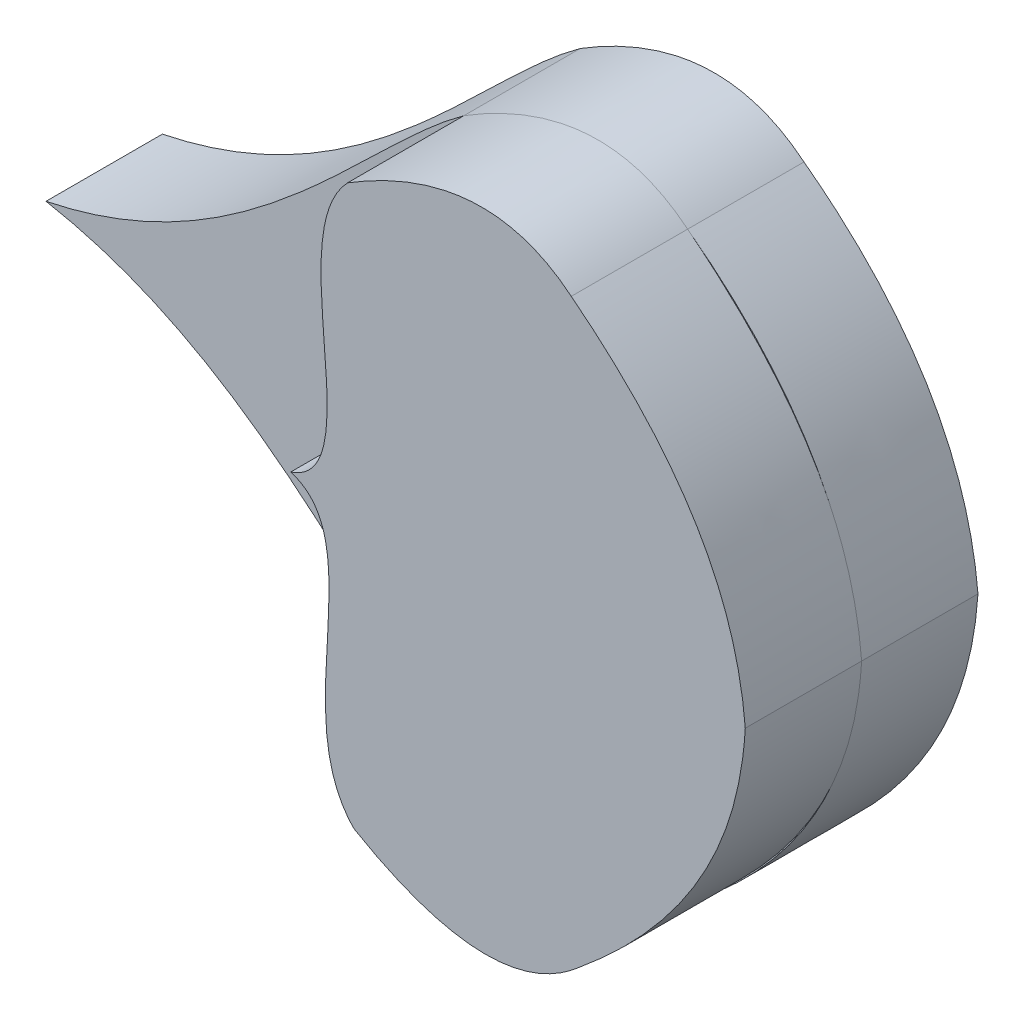
ISO-10303-21;
HEADER;
FILE_DESCRIPTION(('STEP AP214'),'2;1');
FILE_NAME('part.step','',(''),(''),'','','');
FILE_SCHEMA(('AUTOMOTIVE_DESIGN { 1 0 10303 214 1 1 1 1 }'));
ENDSEC;
DATA;
#1=APPLICATION_CONTEXT('core data for automotive mechanical design processes');
#2=APPLICATION_PROTOCOL_DEFINITION('international standard','automotive_design',2000,#1);
#3=PRODUCT_CONTEXT('',#1,'mechanical');
#4=PRODUCT('Part','Part','',(#3));
#5=PRODUCT_RELATED_PRODUCT_CATEGORY('part','',(#4));
#6=PRODUCT_DEFINITION_FORMATION('','',#4);
#7=PRODUCT_DEFINITION_CONTEXT('part definition',#1,'design');
#8=PRODUCT_DEFINITION('design','',#6,#7);
#9=PRODUCT_DEFINITION_SHAPE('','',#8);
#10=(LENGTH_UNIT() NAMED_UNIT(*) SI_UNIT(.MILLI.,.METRE.));
#11=(NAMED_UNIT(*) PLANE_ANGLE_UNIT() SI_UNIT($,.RADIAN.));
#12=(NAMED_UNIT(*) SI_UNIT($,.STERADIAN.) SOLID_ANGLE_UNIT());
#13=UNCERTAINTY_MEASURE_WITH_UNIT(LENGTH_MEASURE(1.E-05),#10,'distance_accuracy_value','');
#14=(GEOMETRIC_REPRESENTATION_CONTEXT(3) GLOBAL_UNCERTAINTY_ASSIGNED_CONTEXT((#13)) GLOBAL_UNIT_ASSIGNED_CONTEXT((#10,
#11,#12)) REPRESENTATION_CONTEXT('',''));
#15=CARTESIAN_POINT('',(0.,0.,0.));
#16=DIRECTION('',(0.,0.,1.));
#17=DIRECTION('',(1.,0.,0.));
#18=AXIS2_PLACEMENT_3D('',#15,#16,#17);
#19=CARTESIAN_POINT('',(968.022053994673,850.236833230224,10.));
#20=DIRECTION('',(0.,0.,1.));
#21=DIRECTION('',(1.,0.,0.));
#22=AXIS2_PLACEMENT_3D('',#19,#20,#21);
#23=PLANE('',#22);
#24=CARTESIAN_POINT('',(957.735487359216,838.736040902496,10.));
#25=CARTESIAN_POINT('',(968.378453265853,847.487101285989,10.));
#26=CARTESIAN_POINT('',(971.635757035158,855.924269837102,10.));
#27=CARTESIAN_POINT('',(972.099331726967,863.749046704113,10.));
#28=B_SPLINE_CURVE_WITH_KNOTS('',3,(#24,#25,#26,#27),.UNSPECIFIED.,.F.,.F.,(4,4),(0.,1.),.UNSPECIFIED.);
#29=CARTESIAN_POINT('',(957.735487359216,838.736040902496,10.));
#30=VERTEX_POINT('',#29);
#31=CARTESIAN_POINT('',(969.549702532147,853.257177179048,10.));
#32=VERTEX_POINT('',#31);
#33=EDGE_CURVE('E246',#30,#32,#28,.T.);
#34=ORIENTED_EDGE('',*,*,#33,.F.);
#35=CARTESIAN_POINT('',(957.735487359216,838.736040902496,10.));
#36=CARTESIAN_POINT('',(971.126698446254,849.231122657143,10.));
#37=CARTESIAN_POINT('',(972.099331726967,863.749046704113,10.));
#38=B_SPLINE_CURVE_WITH_KNOTS('',2,(#35,#36,#37),.UNSPECIFIED.,.F.,.F.,(3,3),(0.,1.),.UNSPECIFIED.);
#39=EDGE_CURVE('E271',#30,#32,#38,.T.);
#40=ORIENTED_EDGE('',*,*,#39,.T.);
#41=EDGE_LOOP('',(#34,#40));
#42=FACE_BOUND('',#41,.T.);
#43=ADVANCED_FACE('F33',(#42),#23,.T.);
#44=CARTESIAN_POINT('',(933.035426869075,863.284850394102,10.));
#45=CARTESIAN_POINT('',(940.179366522484,861.097735963319,10.));
#46=CARTESIAN_POINT('',(932.525850216012,845.382720608083,10.));
#47=CARTESIAN_POINT('',(938.486444548531,839.444092274462,10.));
#48=B_SPLINE_CURVE_WITH_KNOTS('',3,(#44,#45,#46,#47),.UNSPECIFIED.,.F.,.F.,(4,4),(0.,1.),.UNSPECIFIED.);
#49=CARTESIAN_POINT('',(933.035426869075,863.284850394102,10.));
#50=VERTEX_POINT('',#49);
#51=CARTESIAN_POINT('',(938.486444548531,839.444092274462,10.));
#52=VERTEX_POINT('',#51);
#53=EDGE_CURVE('E50',#50,#52,#48,.T.);
#54=ORIENTED_EDGE('',*,*,#53,.F.);
#55=CARTESIAN_POINT('',(937.918385962368,887.24840714084,10.));
#56=CARTESIAN_POINT('',(932.100592224003,881.169816243304,10.));
#57=CARTESIAN_POINT('',(940.12537766323,865.641106119051,10.));
#58=CARTESIAN_POINT('',(933.035426869075,863.284850394102,10.));
#59=B_SPLINE_CURVE_WITH_KNOTS('',3,(#55,#56,#57,#58),.UNSPECIFIED.,.F.,.F.,(4,4),(0.,1.),.UNSPECIFIED.);
#60=CARTESIAN_POINT('',(937.918385962368,887.24840714084,10.));
#61=VERTEX_POINT('',#60);
#62=EDGE_CURVE('E229',#61,#50,#59,.T.);
#63=ORIENTED_EDGE('',*,*,#62,.F.);
#64=CARTESIAN_POINT('',(937.918385962368,887.24840714084,10.));
#65=CARTESIAN_POINT('',(929.194376628945,880.985015824536,10.));
#66=CARTESIAN_POINT('',(919.818300000637,866.577185524126,10.));
#67=CARTESIAN_POINT('',(902.002218730464,862.916082838524,10.));
#68=B_SPLINE_CURVE_WITH_KNOTS('',3,(#64,#65,#66,#67),.UNSPECIFIED.,.F.,.F.,(4,4),(0.,1.),.UNSPECIFIED.);
#69=CARTESIAN_POINT('',(902.002218730464,862.916082838524,10.));
#70=VERTEX_POINT('',#69);
#71=EDGE_CURVE('E284',#61,#70,#68,.T.);
#72=ORIENTED_EDGE('',*,*,#71,.T.);
#73=CARTESIAN_POINT('',(902.002218730464,862.916082838524,10.));
#74=CARTESIAN_POINT('',(919.900266717,859.679371085589,10.));
#75=CARTESIAN_POINT('',(929.61606390718,845.498409486861,10.));
#76=CARTESIAN_POINT('',(938.486444548531,839.444092274462,10.));
#77=B_SPLINE_CURVE_WITH_KNOTS('',3,(#73,#74,#75,#76),.UNSPECIFIED.,.F.,.F.,(4,4),(0.,1.),.UNSPECIFIED.);
#78=EDGE_CURVE('E304',#70,#52,#77,.T.);
#79=ORIENTED_EDGE('',*,*,#78,.T.);
#80=EDGE_LOOP('',(#54,#63,#72,#79));
#81=FACE_BOUND('',#80,.T.);
#82=ADVANCED_FACE('F339',(#81),#23,.T.);
#83=DIRECTION('',(0.,0.,-1.));
#84=VECTOR('',#83,1.);
#85=SURFACE_OF_LINEAR_EXTRUSION('',#38,#84);
#86=CARTESIAN_POINT('',(957.735487359216,838.736040902496,0.));
#87=CARTESIAN_POINT('',(971.126698446254,849.231122657143,0.));
#88=CARTESIAN_POINT('',(972.099331726967,863.749046704113,0.));
#89=B_SPLINE_CURVE_WITH_KNOTS('',2,(#86,#87,#88),.UNSPECIFIED.,.F.,.F.,(3,3),(0.,1.),.UNSPECIFIED.);
#90=CARTESIAN_POINT('',(957.735487359216,838.736040902496,0.));
#91=VERTEX_POINT('',#90);
#92=CARTESIAN_POINT('',(972.099331726967,863.749046704113,0.));
#93=VERTEX_POINT('',#92);
#94=EDGE_CURVE('E141',#91,#93,#89,.T.);
#95=ORIENTED_EDGE('',*,*,#94,.T.);
#96=DIRECTION('',(0.,0.,-1.));
#97=VECTOR('',#96,1.);
#98=CARTESIAN_POINT('',(972.099331726967,863.749046704113,10.));
#99=LINE('',#98,#97);
#100=CARTESIAN_POINT('',(972.099331726967,863.749046704113,10.));
#101=VERTEX_POINT('',#100);
#102=EDGE_CURVE('E43',#101,#93,#99,.T.);
#103=ORIENTED_EDGE('',*,*,#102,.F.);
#104=EDGE_CURVE('E275',#32,#101,#38,.T.);
#105=ORIENTED_EDGE('',*,*,#104,.F.);
#106=ORIENTED_EDGE('',*,*,#39,.F.);
#107=DIRECTION('',(0.,0.,-1.));
#108=VECTOR('',#107,1.);
#109=CARTESIAN_POINT('',(957.735487359216,838.736040902496,10.));
#110=LINE('',#109,#108);
#111=EDGE_CURVE('E454',#30,#91,#110,.T.);
#112=ORIENTED_EDGE('',*,*,#111,.T.);
#113=EDGE_LOOP('',(#95,#103,#105,#106,#112));
#114=FACE_BOUND('',#113,.T.);
#115=ADVANCED_FACE('F35',(#114),#85,.F.);
#116=CARTESIAN_POINT('',(972.099331726967,863.749046704113,10.));
#117=CARTESIAN_POINT('',(970.781988873994,878.239758968873,10.));
#118=CARTESIAN_POINT('',(957.145168223018,888.413666671788,10.));
#119=B_SPLINE_CURVE_WITH_KNOTS('',2,(#116,#117,#118),.UNSPECIFIED.,.F.,.F.,(3,3),(0.,1.),.UNSPECIFIED.);
#120=DIRECTION('',(0.,0.,-1.));
#121=VECTOR('',#120,1.);
#122=SURFACE_OF_LINEAR_EXTRUSION('',#119,#121);
#123=CARTESIAN_POINT('',(972.099331726967,863.749046704113,0.));
#124=CARTESIAN_POINT('',(970.781988873994,878.239758968873,0.));
#125=CARTESIAN_POINT('',(957.145168223018,888.413666671788,0.));
#126=B_SPLINE_CURVE_WITH_KNOTS('',2,(#123,#124,#125),.UNSPECIFIED.,.F.,.F.,(3,3),(0.,1.),.UNSPECIFIED.);
#127=CARTESIAN_POINT('',(957.145168223018,888.413666671788,0.));
#128=VERTEX_POINT('',#127);
#129=EDGE_CURVE('E144',#93,#128,#126,.T.);
#130=ORIENTED_EDGE('',*,*,#129,.T.);
#131=DIRECTION('',(0.,0.,-1.));
#132=VECTOR('',#131,1.);
#133=CARTESIAN_POINT('',(957.145168223018,888.413666671788,10.));
#134=LINE('',#133,#132);
#135=CARTESIAN_POINT('',(957.145168223018,888.413666671788,10.));
#136=VERTEX_POINT('',#135);
#137=EDGE_CURVE('E291',#136,#128,#134,.T.);
#138=ORIENTED_EDGE('',*,*,#137,.F.);
#139=CARTESIAN_POINT('',(969.301107946427,874.177367702007,10.));
#140=VERTEX_POINT('',#139);
#141=EDGE_CURVE('E274',#140,#136,#119,.T.);
#142=ORIENTED_EDGE('',*,*,#141,.F.);
#143=EDGE_CURVE('E280',#101,#140,#119,.T.);
#144=ORIENTED_EDGE('',*,*,#143,.F.);
#145=ORIENTED_EDGE('',*,*,#102,.T.);
#146=EDGE_LOOP('',(#130,#138,#142,#144,#145));
#147=FACE_BOUND('',#146,.T.);
#148=ADVANCED_FACE('F332',(#147),#122,.F.);
#149=CARTESIAN_POINT('',(957.145168223018,888.413666671788,10.));
#150=CARTESIAN_POINT('',(949.699675094382,894.522789238874,10.));
#151=CARTESIAN_POINT('',(937.918385962368,887.24840714084,10.));
#152=B_SPLINE_CURVE_WITH_KNOTS('',2,(#149,#150,#151),.UNSPECIFIED.,.F.,.F.,(3,3),(0.,1.),.UNSPECIFIED.);
#153=DIRECTION('',(0.,0.,-1.));
#154=VECTOR('',#153,1.);
#155=SURFACE_OF_LINEAR_EXTRUSION('',#152,#154);
#156=CARTESIAN_POINT('',(957.145168223018,888.413666671788,0.));
#157=CARTESIAN_POINT('',(949.699675094382,894.522789238874,0.));
#158=CARTESIAN_POINT('',(937.918385962368,887.24840714084,0.));
#159=B_SPLINE_CURVE_WITH_KNOTS('',2,(#156,#157,#158),.UNSPECIFIED.,.F.,.F.,(3,3),(0.,1.),.UNSPECIFIED.);
#160=CARTESIAN_POINT('',(937.918385962368,887.24840714084,0.));
#161=VERTEX_POINT('',#160);
#162=EDGE_CURVE('E379',#128,#161,#159,.T.);
#163=ORIENTED_EDGE('',*,*,#162,.T.);
#164=DIRECTION('',(0.,0.,-1.));
#165=VECTOR('',#164,1.);
#166=CARTESIAN_POINT('',(937.918385962368,887.24840714084,10.));
#167=LINE('',#166,#165);
#168=EDGE_CURVE('E294',#61,#161,#167,.T.);
#169=ORIENTED_EDGE('',*,*,#168,.F.);
#170=CARTESIAN_POINT('',(957.145168223018,888.413666671788,10.));
#171=CARTESIAN_POINT('',(949.711771305971,894.537501805254,10.));
#172=CARTESIAN_POINT('',(937.918385962368,887.24840714084,10.));
#173=B_SPLINE_CURVE_WITH_KNOTS('',2,(#170,#171,#172),.UNSPECIFIED.,.F.,.F.,(3,3),(0.,1.),.UNSPECIFIED.);
#174=EDGE_CURVE('E156',#136,#61,#173,.T.);
#175=ORIENTED_EDGE('',*,*,#174,.F.);
#176=ORIENTED_EDGE('',*,*,#137,.T.);
#177=EDGE_LOOP('',(#163,#169,#175,#176));
#178=FACE_BOUND('',#177,.T.);
#179=ADVANCED_FACE('F327',(#178),#155,.F.);
#180=DIRECTION('',(0.,0.,-1.));
#181=VECTOR('',#180,1.);
#182=SURFACE_OF_LINEAR_EXTRUSION('',#68,#181);
#183=CARTESIAN_POINT('',(937.918385962368,887.24840714084,0.));
#184=CARTESIAN_POINT('',(929.194376628945,880.985015824536,0.));
#185=CARTESIAN_POINT('',(919.818300000637,866.577185524126,0.));
#186=CARTESIAN_POINT('',(902.002218730464,862.916082838524,0.));
#187=B_SPLINE_CURVE_WITH_KNOTS('',3,(#183,#184,#185,#186),.UNSPECIFIED.,.F.,.F.,(4,4),(0.,1.),.UNSPECIFIED.);
#188=CARTESIAN_POINT('',(902.002218730464,862.916082838524,0.));
#189=VERTEX_POINT('',#188);
#190=EDGE_CURVE('E386',#161,#189,#187,.T.);
#191=ORIENTED_EDGE('',*,*,#190,.T.);
#192=DIRECTION('',(0.,0.,-1.));
#193=VECTOR('',#192,1.);
#194=CARTESIAN_POINT('',(902.002218730464,862.916082838524,10.));
#195=LINE('',#194,#193);
#196=EDGE_CURVE('E299',#70,#189,#195,.T.);
#197=ORIENTED_EDGE('',*,*,#196,.F.);
#198=ORIENTED_EDGE('',*,*,#71,.F.);
#199=ORIENTED_EDGE('',*,*,#168,.T.);
#200=EDGE_LOOP('',(#191,#197,#198,#199));
#201=FACE_BOUND('',#200,.T.);
#202=ADVANCED_FACE('F323',(#201),#182,.F.);
#203=DIRECTION('',(0.,0.,-1.));
#204=VECTOR('',#203,1.);
#205=SURFACE_OF_LINEAR_EXTRUSION('',#77,#204);
#206=CARTESIAN_POINT('',(902.002218730464,862.916082838524,0.));
#207=CARTESIAN_POINT('',(919.900266717,859.679371085589,0.));
#208=CARTESIAN_POINT('',(929.61606390718,845.498409486861,0.));
#209=CARTESIAN_POINT('',(938.486444548531,839.444092274462,0.));
#210=B_SPLINE_CURVE_WITH_KNOTS('',3,(#206,#207,#208,#209),.UNSPECIFIED.,.F.,.F.,(4,4),(0.,1.),.UNSPECIFIED.);
#211=CARTESIAN_POINT('',(938.486444548531,839.444092274462,0.));
#212=VERTEX_POINT('',#211);
#213=EDGE_CURVE('E393',#189,#212,#210,.T.);
#214=ORIENTED_EDGE('',*,*,#213,.T.);
#215=DIRECTION('',(0.,0.,-1.));
#216=VECTOR('',#215,1.);
#217=CARTESIAN_POINT('',(938.486444548531,839.444092274462,10.));
#218=LINE('',#217,#216);
#219=EDGE_CURVE('E411',#52,#212,#218,.T.);
#220=ORIENTED_EDGE('',*,*,#219,.F.);
#221=ORIENTED_EDGE('',*,*,#78,.F.);
#222=ORIENTED_EDGE('',*,*,#196,.T.);
#223=EDGE_LOOP('',(#214,#220,#221,#222));
#224=FACE_BOUND('',#223,.T.);
#225=ADVANCED_FACE('F326',(#224),#205,.F.);
#226=CARTESIAN_POINT('',(938.486444548531,839.444092274462,10.));
#227=CARTESIAN_POINT('',(950.437265510964,832.451718797294,10.));
#228=CARTESIAN_POINT('',(957.735487359216,838.736040902496,10.));
#229=B_SPLINE_CURVE_WITH_KNOTS('',2,(#226,#227,#228),.UNSPECIFIED.,.F.,.F.,(3,3),(0.,1.),.UNSPECIFIED.);
#230=DIRECTION('',(0.,0.,-1.));
#231=VECTOR('',#230,1.);
#232=SURFACE_OF_LINEAR_EXTRUSION('',#229,#231);
#233=CARTESIAN_POINT('',(938.486444548531,839.444092274462,0.));
#234=CARTESIAN_POINT('',(950.437265510964,832.451718797294,0.));
#235=CARTESIAN_POINT('',(957.735487359216,838.736040902496,0.));
#236=B_SPLINE_CURVE_WITH_KNOTS('',2,(#233,#234,#235),.UNSPECIFIED.,.F.,.F.,(3,3),(0.,1.),.UNSPECIFIED.);
#237=EDGE_CURVE('E279',#212,#91,#236,.T.);
#238=ORIENTED_EDGE('',*,*,#237,.T.);
#239=ORIENTED_EDGE('',*,*,#111,.F.);
#240=CARTESIAN_POINT('',(938.486444548531,839.444092274462,10.));
#241=CARTESIAN_POINT('',(950.44970791636,832.437297823255,10.));
#242=CARTESIAN_POINT('',(957.735487359216,838.736040902496,10.));
#243=B_SPLINE_CURVE_WITH_KNOTS('',2,(#240,#241,#242),.UNSPECIFIED.,.F.,.F.,(3,3),(0.,1.),.UNSPECIFIED.);
#244=EDGE_CURVE('E450',#52,#30,#243,.T.);
#245=ORIENTED_EDGE('',*,*,#244,.F.);
#246=ORIENTED_EDGE('',*,*,#219,.T.);
#247=EDGE_LOOP('',(#238,#239,#245,#246));
#248=FACE_BOUND('',#247,.T.);
#249=ADVANCED_FACE('F351',(#248),#232,.F.);
#250=CARTESIAN_POINT('',(972.099331726967,863.749046704113,10.));
#251=CARTESIAN_POINT('',(971.449950572395,871.560598318837,10.));
#252=CARTESIAN_POINT('',(967.993077165875,879.917982314843,10.));
#253=CARTESIAN_POINT('',(957.145168223018,888.413666671788,10.));
#254=B_SPLINE_CURVE_WITH_KNOTS('',3,(#250,#251,#252,#253),.UNSPECIFIED.,.F.,.F.,(4,4),(0.,1.),.UNSPECIFIED.);
#255=EDGE_CURVE('E11',#140,#136,#254,.T.);
#256=ORIENTED_EDGE('',*,*,#255,.F.);
#257=ORIENTED_EDGE('',*,*,#141,.T.);
#258=EDGE_LOOP('',(#256,#257));
#259=FACE_BOUND('',#258,.T.);
#260=ADVANCED_FACE('F344',(#259),#23,.T.);
#261=CARTESIAN_POINT('',(968.022053994673,850.236833230224,0.));
#262=DIRECTION('',(0.,0.,1.));
#263=DIRECTION('',(1.,0.,0.));
#264=AXIS2_PLACEMENT_3D('',#261,#262,#263);
#265=PLANE('',#264);
#266=ORIENTED_EDGE('',*,*,#94,.F.);
#267=ORIENTED_EDGE('',*,*,#237,.F.);
#268=ORIENTED_EDGE('',*,*,#213,.F.);
#269=ORIENTED_EDGE('',*,*,#190,.F.);
#270=ORIENTED_EDGE('',*,*,#162,.F.);
#271=ORIENTED_EDGE('',*,*,#129,.F.);
#272=EDGE_LOOP('',(#266,#267,#268,#269,#270,#271));
#273=FACE_BOUND('',#272,.T.);
#274=ADVANCED_FACE('F350',(#273),#265,.F.);
#275=CARTESIAN_POINT('',(968.734681248652,851.589900121985,10.));
#276=DIRECTION('',(0.,0.,-1.));
#277=DIRECTION('',(-1.,0.,0.));
#278=AXIS2_PLACEMENT_3D('',#275,#276,#277);
#279=PLANE('',#278);
#280=EDGE_CURVE('E139',#32,#101,#28,.T.);
#281=ORIENTED_EDGE('',*,*,#280,.F.);
#282=ORIENTED_EDGE('',*,*,#104,.T.);
#283=EDGE_LOOP('',(#281,#282));
#284=FACE_BOUND('',#283,.T.);
#285=ADVANCED_FACE('F356',(#284),#279,.T.);
#286=CARTESIAN_POINT('',(957.735487359216,838.736040902496,20.));
#287=CARTESIAN_POINT('',(968.378453265853,847.487101285989,20.));
#288=CARTESIAN_POINT('',(971.635757035158,855.924269837102,20.));
#289=CARTESIAN_POINT('',(972.099331726967,863.749046704113,20.));
#290=B_SPLINE_CURVE_WITH_KNOTS('',3,(#286,#287,#288,#289),.UNSPECIFIED.,.F.,.F.,(4,4),(0.,1.),.UNSPECIFIED.);
#291=DIRECTION('',(0.,0.,-1.));
#292=VECTOR('',#291,1.);
#293=SURFACE_OF_LINEAR_EXTRUSION('',#290,#292);
#294=ORIENTED_EDGE('',*,*,#33,.T.);
#295=ORIENTED_EDGE('',*,*,#280,.T.);
#296=DIRECTION('',(0.,0.,-1.));
#297=VECTOR('',#296,1.);
#298=CARTESIAN_POINT('',(972.099331726967,863.749046704113,20.));
#299=LINE('',#298,#297);
#300=CARTESIAN_POINT('',(972.099331726967,863.749046704113,20.));
#301=VERTEX_POINT('',#300);
#302=EDGE_CURVE('E119',#301,#101,#299,.T.);
#303=ORIENTED_EDGE('',*,*,#302,.F.);
#304=CARTESIAN_POINT('',(957.735487359216,838.736040902496,20.));
#305=VERTEX_POINT('',#304);
#306=EDGE_CURVE('E125',#305,#301,#290,.T.);
#307=ORIENTED_EDGE('',*,*,#306,.F.);
#308=DIRECTION('',(0.,0.,-1.));
#309=VECTOR('',#308,1.);
#310=CARTESIAN_POINT('',(957.735487359216,838.736040902496,20.));
#311=LINE('',#310,#309);
#312=EDGE_CURVE('E240',#305,#30,#311,.T.);
#313=ORIENTED_EDGE('',*,*,#312,.T.);
#314=EDGE_LOOP('',(#294,#295,#303,#307,#313));
#315=FACE_BOUND('',#314,.T.);
#316=ADVANCED_FACE('F137',(#315),#293,.F.);
#317=CARTESIAN_POINT('',(972.099331726967,863.749046704113,20.));
#318=CARTESIAN_POINT('',(971.449950572395,871.560598318837,20.));
#319=CARTESIAN_POINT('',(967.993077165875,879.917982314843,20.));
#320=CARTESIAN_POINT('',(957.145168223018,888.413666671788,20.));
#321=B_SPLINE_CURVE_WITH_KNOTS('',3,(#317,#318,#319,#320),.UNSPECIFIED.,.F.,.F.,(4,4),(0.,1.),.UNSPECIFIED.);
#322=DIRECTION('',(0.,0.,-1.));
#323=VECTOR('',#322,1.);
#324=SURFACE_OF_LINEAR_EXTRUSION('',#321,#323);
#325=EDGE_CURVE('E162',#101,#140,#254,.T.);
#326=ORIENTED_EDGE('',*,*,#325,.T.);
#327=ORIENTED_EDGE('',*,*,#255,.T.);
#328=DIRECTION('',(0.,0.,-1.));
#329=VECTOR('',#328,1.);
#330=CARTESIAN_POINT('',(957.145168223018,888.413666671788,20.));
#331=LINE('',#330,#329);
#332=CARTESIAN_POINT('',(957.145168223018,888.413666671788,20.));
#333=VERTEX_POINT('',#332);
#334=EDGE_CURVE('E121',#333,#136,#331,.T.);
#335=ORIENTED_EDGE('',*,*,#334,.F.);
#336=EDGE_CURVE('E114',#301,#333,#321,.T.);
#337=ORIENTED_EDGE('',*,*,#336,.F.);
#338=ORIENTED_EDGE('',*,*,#302,.T.);
#339=EDGE_LOOP('',(#326,#327,#335,#337,#338));
#340=FACE_BOUND('',#339,.T.);
#341=ADVANCED_FACE('F117',(#340),#324,.F.);
#342=CARTESIAN_POINT('',(957.145168223018,888.413666671788,20.));
#343=CARTESIAN_POINT('',(949.711771305971,894.537501805254,20.));
#344=CARTESIAN_POINT('',(937.918385962368,887.24840714084,20.));
#345=B_SPLINE_CURVE_WITH_KNOTS('',2,(#342,#343,#344),.UNSPECIFIED.,.F.,.F.,(3,3),(0.,1.),.UNSPECIFIED.);
#346=DIRECTION('',(0.,0.,-1.));
#347=VECTOR('',#346,1.);
#348=SURFACE_OF_LINEAR_EXTRUSION('',#345,#347);
#349=ORIENTED_EDGE('',*,*,#174,.T.);
#350=DIRECTION('',(0.,0.,-1.));
#351=VECTOR('',#350,1.);
#352=CARTESIAN_POINT('',(937.918385962368,887.24840714084,20.));
#353=LINE('',#352,#351);
#354=CARTESIAN_POINT('',(937.918385962368,887.24840714084,20.));
#355=VERTEX_POINT('',#354);
#356=EDGE_CURVE('E146',#355,#61,#353,.T.);
#357=ORIENTED_EDGE('',*,*,#356,.F.);
#358=EDGE_CURVE('E124',#333,#355,#345,.T.);
#359=ORIENTED_EDGE('',*,*,#358,.F.);
#360=ORIENTED_EDGE('',*,*,#334,.T.);
#361=EDGE_LOOP('',(#349,#357,#359,#360));
#362=FACE_BOUND('',#361,.T.);
#363=ADVANCED_FACE('F163',(#362),#348,.F.);
#364=CARTESIAN_POINT('',(937.918385962368,887.24840714084,20.));
#365=CARTESIAN_POINT('',(932.100592224003,881.169816243304,20.));
#366=CARTESIAN_POINT('',(940.12537766323,865.641106119051,20.));
#367=CARTESIAN_POINT('',(933.035426869075,863.284850394102,20.));
#368=B_SPLINE_CURVE_WITH_KNOTS('',3,(#364,#365,#366,#367),.UNSPECIFIED.,.F.,.F.,(4,4),(0.,1.),.UNSPECIFIED.);
#369=DIRECTION('',(0.,0.,-1.));
#370=VECTOR('',#369,1.);
#371=SURFACE_OF_LINEAR_EXTRUSION('',#368,#370);
#372=ORIENTED_EDGE('',*,*,#62,.T.);
#373=DIRECTION('',(0.,0.,-1.));
#374=VECTOR('',#373,1.);
#375=CARTESIAN_POINT('',(933.035426869075,863.284850394102,20.));
#376=LINE('',#375,#374);
#377=CARTESIAN_POINT('',(933.035426869075,863.284850394102,20.));
#378=VERTEX_POINT('',#377);
#379=EDGE_CURVE('E150',#378,#50,#376,.T.);
#380=ORIENTED_EDGE('',*,*,#379,.F.);
#381=EDGE_CURVE('E181',#355,#378,#368,.T.);
#382=ORIENTED_EDGE('',*,*,#381,.F.);
#383=ORIENTED_EDGE('',*,*,#356,.T.);
#384=EDGE_LOOP('',(#372,#380,#382,#383));
#385=FACE_BOUND('',#384,.T.);
#386=ADVANCED_FACE('F174',(#385),#371,.F.);
#387=CARTESIAN_POINT('',(933.035426869075,863.284850394102,20.));
#388=CARTESIAN_POINT('',(940.179366522484,861.097735963319,20.));
#389=CARTESIAN_POINT('',(932.525850216012,845.382720608083,20.));
#390=CARTESIAN_POINT('',(938.486444548531,839.444092274462,20.));
#391=B_SPLINE_CURVE_WITH_KNOTS('',3,(#387,#388,#389,#390),.UNSPECIFIED.,.F.,.F.,(4,4),(0.,1.),.UNSPECIFIED.);
#392=DIRECTION('',(0.,0.,-1.));
#393=VECTOR('',#392,1.);
#394=SURFACE_OF_LINEAR_EXTRUSION('',#391,#393);
#395=ORIENTED_EDGE('',*,*,#53,.T.);
#396=DIRECTION('',(0.,0.,-1.));
#397=VECTOR('',#396,1.);
#398=CARTESIAN_POINT('',(938.486444548531,839.444092274462,20.));
#399=LINE('',#398,#397);
#400=CARTESIAN_POINT('',(938.486444548531,839.444092274462,20.));
#401=VERTEX_POINT('',#400);
#402=EDGE_CURVE('E234',#401,#52,#399,.T.);
#403=ORIENTED_EDGE('',*,*,#402,.F.);
#404=EDGE_CURVE('E192',#378,#401,#391,.T.);
#405=ORIENTED_EDGE('',*,*,#404,.F.);
#406=ORIENTED_EDGE('',*,*,#379,.T.);
#407=EDGE_LOOP('',(#395,#403,#405,#406));
#408=FACE_BOUND('',#407,.T.);
#409=ADVANCED_FACE('F205',(#408),#394,.F.);
#410=CARTESIAN_POINT('',(938.486444548531,839.444092274462,20.));
#411=CARTESIAN_POINT('',(950.44970791636,832.437297823255,20.));
#412=CARTESIAN_POINT('',(957.735487359216,838.736040902496,20.));
#413=B_SPLINE_CURVE_WITH_KNOTS('',2,(#410,#411,#412),.UNSPECIFIED.,.F.,.F.,(3,3),(0.,1.),.UNSPECIFIED.);
#414=DIRECTION('',(0.,0.,-1.));
#415=VECTOR('',#414,1.);
#416=SURFACE_OF_LINEAR_EXTRUSION('',#413,#415);
#417=ORIENTED_EDGE('',*,*,#244,.T.);
#418=ORIENTED_EDGE('',*,*,#312,.F.);
#419=EDGE_CURVE('E130',#401,#305,#413,.T.);
#420=ORIENTED_EDGE('',*,*,#419,.F.);
#421=ORIENTED_EDGE('',*,*,#402,.T.);
#422=EDGE_LOOP('',(#417,#418,#420,#421));
#423=FACE_BOUND('',#422,.T.);
#424=ADVANCED_FACE('F208',(#423),#416,.F.);
#425=CARTESIAN_POINT('',(968.734681248652,851.589900121985,20.));
#426=DIRECTION('',(0.,0.,-1.));
#427=DIRECTION('',(-1.,0.,0.));
#428=AXIS2_PLACEMENT_3D('',#425,#426,#427);
#429=PLANE('',#428);
#430=ORIENTED_EDGE('',*,*,#306,.T.);
#431=ORIENTED_EDGE('',*,*,#336,.T.);
#432=ORIENTED_EDGE('',*,*,#358,.T.);
#433=ORIENTED_EDGE('',*,*,#381,.T.);
#434=ORIENTED_EDGE('',*,*,#404,.T.);
#435=ORIENTED_EDGE('',*,*,#419,.T.);
#436=EDGE_LOOP('',(#430,#431,#432,#433,#434,#435));
#437=FACE_BOUND('',#436,.T.);
#438=ADVANCED_FACE('F128',(#437),#429,.F.);
#439=ORIENTED_EDGE('',*,*,#325,.F.);
#440=ORIENTED_EDGE('',*,*,#143,.T.);
#441=EDGE_LOOP('',(#439,#440));
#442=FACE_BOUND('',#441,.T.);
#443=ADVANCED_FACE('F214',(#442),#279,.T.);
#444=CLOSED_SHELL('',(#43,#82,#115,#148,#179,#202,#225,#249,#260,#274,#285,#316,#341,#363,#386,
#409,#424,#438,#443));
#445=MANIFOLD_SOLID_BREP('B2',#444);
#446=ADVANCED_BREP_SHAPE_REPRESENTATION('',(#18,#445),#14);
#447=SHAPE_DEFINITION_REPRESENTATION(#9,#446);
ENDSEC;
END-ISO-10303-21;
